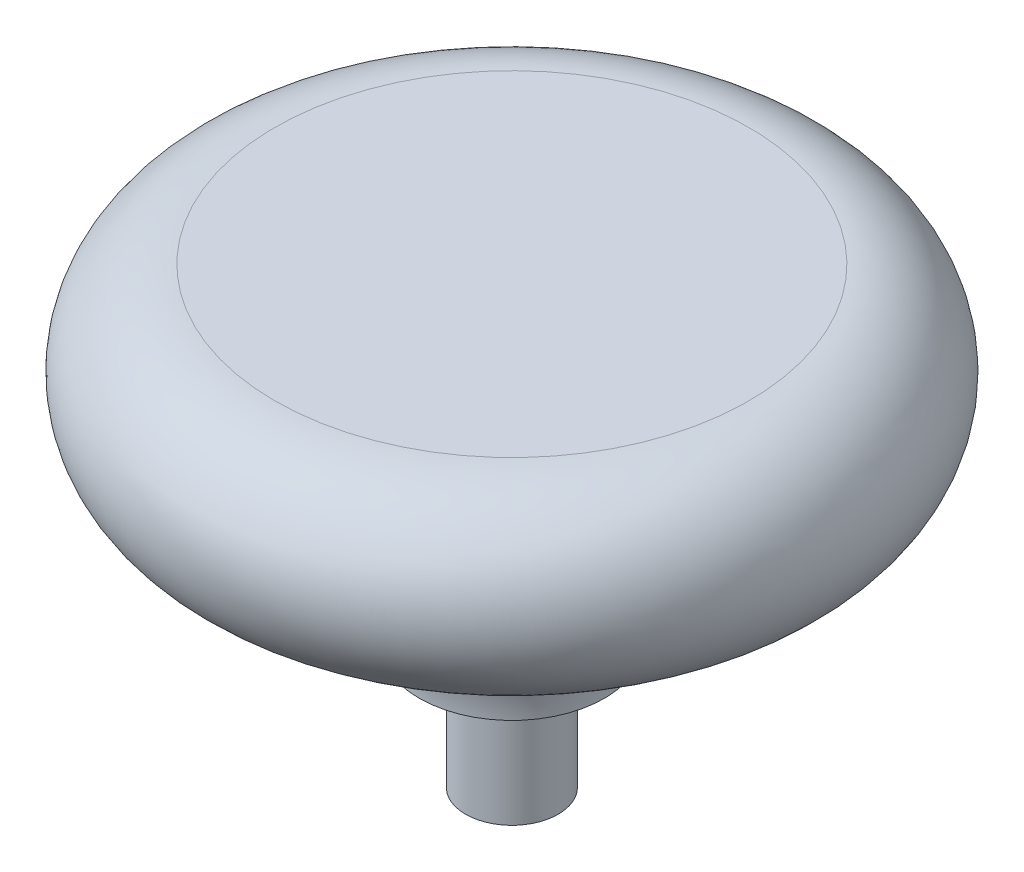
ISO-10303-21;
HEADER;
FILE_DESCRIPTION(('STEP AP214'),'2;1');
FILE_NAME('part.step','',(''),(''),'','','');
FILE_SCHEMA(('AUTOMOTIVE_DESIGN { 1 0 10303 214 1 1 1 1 }'));
ENDSEC;
DATA;
#1=APPLICATION_CONTEXT('core data for automotive mechanical design processes');
#2=APPLICATION_PROTOCOL_DEFINITION('international standard','automotive_design',2000,#1);
#3=PRODUCT_CONTEXT('',#1,'mechanical');
#4=PRODUCT('Part','Part','',(#3));
#5=PRODUCT_RELATED_PRODUCT_CATEGORY('part','',(#4));
#6=PRODUCT_DEFINITION_FORMATION('','',#4);
#7=PRODUCT_DEFINITION_CONTEXT('part definition',#1,'design');
#8=PRODUCT_DEFINITION('design','',#6,#7);
#9=PRODUCT_DEFINITION_SHAPE('','',#8);
#10=(LENGTH_UNIT() NAMED_UNIT(*) SI_UNIT(.MILLI.,.METRE.));
#11=(NAMED_UNIT(*) PLANE_ANGLE_UNIT() SI_UNIT($,.RADIAN.));
#12=(NAMED_UNIT(*) SI_UNIT($,.STERADIAN.) SOLID_ANGLE_UNIT());
#13=UNCERTAINTY_MEASURE_WITH_UNIT(LENGTH_MEASURE(1.E-05),#10,'distance_accuracy_value','');
#14=(GEOMETRIC_REPRESENTATION_CONTEXT(3) GLOBAL_UNCERTAINTY_ASSIGNED_CONTEXT((#13)) GLOBAL_UNIT_ASSIGNED_CONTEXT((#10,
#11,#12)) REPRESENTATION_CONTEXT('',''));
#15=CARTESIAN_POINT('',(0.,0.,0.));
#16=DIRECTION('',(0.,0.,1.));
#17=DIRECTION('',(1.,0.,0.));
#18=AXIS2_PLACEMENT_3D('',#15,#16,#17);
#19=CARTESIAN_POINT('',(0.,0.,0.));
#20=DIRECTION('',(0.,1.,0.));
#21=DIRECTION('',(0.,0.,1.));
#22=AXIS2_PLACEMENT_3D('',#19,#20,#21);
#23=PLANE('',#22);
#24=CARTESIAN_POINT('',(0.,0.,0.));
#25=DIRECTION('',(0.,1.,0.));
#26=DIRECTION('',(0.,0.,1.));
#27=AXIS2_PLACEMENT_3D('',#24,#25,#26);
#28=CIRCLE('',#27,2.25);
#29=CARTESIAN_POINT('',(0.,0.,2.25));
#30=VERTEX_POINT('',#29);
#31=EDGE_CURVE('E10',#30,#30,#28,.T.);
#32=ORIENTED_EDGE('',*,*,#31,.F.);
#33=EDGE_LOOP('',(#32));
#34=FACE_BOUND('',#33,.T.);
#35=ADVANCED_FACE('F31',(#34),#23,.F.);
#36=CARTESIAN_POINT('',(0.,28.9172414839846,0.));
#37=DIRECTION('',(0.,1.,0.));
#38=DIRECTION('',(0.,0.,1.));
#39=AXIS2_PLACEMENT_3D('',#36,#37,#38);
#40=CYLINDRICAL_SURFACE('',#39,2.25);
#41=CARTESIAN_POINT('',(0.,6.,0.));
#42=DIRECTION('',(0.,1.,0.));
#43=DIRECTION('',(0.,0.,1.));
#44=AXIS2_PLACEMENT_3D('',#41,#42,#43);
#45=CIRCLE('',#44,2.25);
#46=CARTESIAN_POINT('',(0.,6.,2.25));
#47=VERTEX_POINT('',#46);
#48=EDGE_CURVE('E37',#47,#47,#45,.T.);
#49=ORIENTED_EDGE('',*,*,#48,.F.);
#50=EDGE_LOOP('',(#49));
#51=FACE_BOUND('',#50,.T.);
#52=ORIENTED_EDGE('',*,*,#31,.T.);
#53=EDGE_LOOP('',(#52));
#54=FACE_BOUND('',#53,.T.);
#55=ADVANCED_FACE('F70',(#51,#54),#40,.T.);
#56=CARTESIAN_POINT('',(2.25,6.,0.));
#57=DIRECTION('',(0.,1.,0.));
#58=DIRECTION('',(0.,0.,1.));
#59=AXIS2_PLACEMENT_3D('',#56,#57,#58);
#60=PLANE('',#59);
#61=CARTESIAN_POINT('',(0.,6.,0.));
#62=DIRECTION('',(0.,1.,0.));
#63=DIRECTION('',(0.,0.,1.));
#64=AXIS2_PLACEMENT_3D('',#61,#62,#63);
#65=CIRCLE('',#64,4.5);
#66=CARTESIAN_POINT('',(0.,6.,4.5));
#67=VERTEX_POINT('',#66);
#68=EDGE_CURVE('E41',#67,#67,#65,.T.);
#69=ORIENTED_EDGE('',*,*,#68,.F.);
#70=EDGE_LOOP('',(#69));
#71=FACE_BOUND('',#70,.T.);
#72=ORIENTED_EDGE('',*,*,#48,.T.);
#73=EDGE_LOOP('',(#72));
#74=FACE_BOUND('',#73,.T.);
#75=ADVANCED_FACE('F65',(#71,#74),#60,.F.);
#76=CARTESIAN_POINT('',(0.,6.,0.));
#77=DIRECTION('',(0.,1.,0.));
#78=DIRECTION('',(0.,0.,1.));
#79=AXIS2_PLACEMENT_3D('',#76,#77,#78);
#80=TOROIDAL_SURFACE('',#79,11.5,7.);
#81=CARTESIAN_POINT('',(0.,13.,0.));
#82=DIRECTION('',(0.,1.,0.));
#83=DIRECTION('',(0.,0.,1.));
#84=AXIS2_PLACEMENT_3D('',#81,#82,#83);
#85=CIRCLE('',#84,11.5);
#86=CARTESIAN_POINT('',(0.,13.,11.5));
#87=VERTEX_POINT('',#86);
#88=EDGE_CURVE('E45',#87,#87,#85,.T.);
#89=ORIENTED_EDGE('',*,*,#88,.F.);
#90=EDGE_LOOP('',(#89));
#91=FACE_BOUND('',#90,.T.);
#92=ORIENTED_EDGE('',*,*,#68,.T.);
#93=EDGE_LOOP('',(#92));
#94=FACE_BOUND('',#93,.T.);
#95=ADVANCED_FACE('F59',(#91,#94),#80,.F.);
#96=CARTESIAN_POINT('',(0.,17.5,0.));
#97=DIRECTION('',(0.,1.,0.));
#98=DIRECTION('',(0.,0.,1.));
#99=AXIS2_PLACEMENT_3D('',#96,#97,#98);
#100=TOROIDAL_SURFACE('',#99,11.5,4.5);
#101=CARTESIAN_POINT('',(0.,22.,0.));
#102=DIRECTION('',(0.,1.,0.));
#103=DIRECTION('',(0.,0.,1.));
#104=AXIS2_PLACEMENT_3D('',#101,#102,#103);
#105=CIRCLE('',#104,11.5);
#106=CARTESIAN_POINT('',(0.,22.,11.5));
#107=VERTEX_POINT('',#106);
#108=EDGE_CURVE('E50',#107,#107,#105,.T.);
#109=ORIENTED_EDGE('',*,*,#108,.F.);
#110=EDGE_LOOP('',(#109));
#111=FACE_BOUND('',#110,.T.);
#112=ORIENTED_EDGE('',*,*,#88,.T.);
#113=EDGE_LOOP('',(#112));
#114=FACE_BOUND('',#113,.T.);
#115=ADVANCED_FACE('F56',(#111,#114),#100,.T.);
#116=CARTESIAN_POINT('',(0.,22.,0.));
#117=DIRECTION('',(0.,-1.,0.));
#118=DIRECTION('',(0.,0.,-1.));
#119=AXIS2_PLACEMENT_3D('',#116,#117,#118);
#120=PLANE('',#119);
#121=ORIENTED_EDGE('',*,*,#108,.T.);
#122=EDGE_LOOP('',(#121));
#123=FACE_BOUND('',#122,.T.);
#124=ADVANCED_FACE('F54',(#123),#120,.F.);
#125=CLOSED_SHELL('',(#35,#55,#75,#95,#115,#124));
#126=MANIFOLD_SOLID_BREP('B2',#125);
#127=ADVANCED_BREP_SHAPE_REPRESENTATION('',(#18,#126),#14);
#128=SHAPE_DEFINITION_REPRESENTATION(#9,#127);
ENDSEC;
END-ISO-10303-21;
